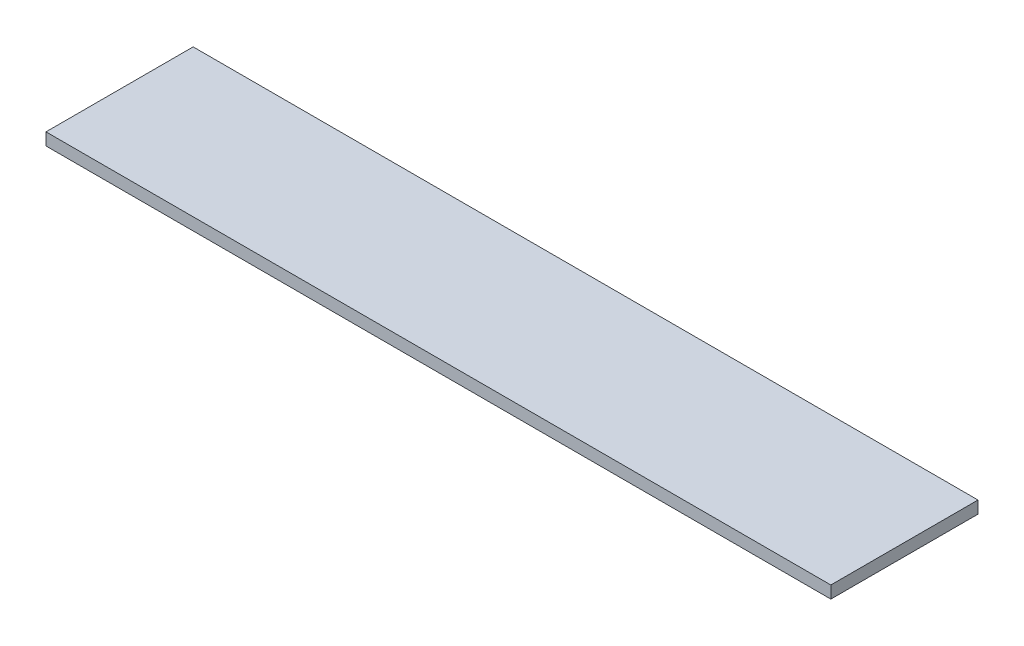
ISO-10303-21;
HEADER;
FILE_DESCRIPTION(('STEP AP214'),'2;1');
FILE_NAME('part.step','',(''),(''),'','','');
FILE_SCHEMA(('AUTOMOTIVE_DESIGN { 1 0 10303 214 1 1 1 1 }'));
ENDSEC;
DATA;
#1=APPLICATION_CONTEXT('core data for automotive mechanical design processes');
#2=APPLICATION_PROTOCOL_DEFINITION('international standard','automotive_design',2000,#1);
#3=PRODUCT_CONTEXT('',#1,'mechanical');
#4=PRODUCT('Part','Part','',(#3));
#5=PRODUCT_RELATED_PRODUCT_CATEGORY('part','',(#4));
#6=PRODUCT_DEFINITION_FORMATION('','',#4);
#7=PRODUCT_DEFINITION_CONTEXT('part definition',#1,'design');
#8=PRODUCT_DEFINITION('design','',#6,#7);
#9=PRODUCT_DEFINITION_SHAPE('','',#8);
#10=(LENGTH_UNIT() NAMED_UNIT(*) SI_UNIT(.MILLI.,.METRE.));
#11=(NAMED_UNIT(*) PLANE_ANGLE_UNIT() SI_UNIT($,.RADIAN.));
#12=(NAMED_UNIT(*) SI_UNIT($,.STERADIAN.) SOLID_ANGLE_UNIT());
#13=UNCERTAINTY_MEASURE_WITH_UNIT(LENGTH_MEASURE(1.E-05),#10,'distance_accuracy_value','');
#14=(GEOMETRIC_REPRESENTATION_CONTEXT(3) GLOBAL_UNCERTAINTY_ASSIGNED_CONTEXT((#13)) GLOBAL_UNIT_ASSIGNED_CONTEXT((#10,
#11,#12)) REPRESENTATION_CONTEXT('',''));
#15=CARTESIAN_POINT('',(0.,0.,0.));
#16=DIRECTION('',(0.,0.,1.));
#17=DIRECTION('',(1.,0.,0.));
#18=AXIS2_PLACEMENT_3D('',#15,#16,#17);
#19=CARTESIAN_POINT('',(0.,6.35000000000008,0.));
#20=DIRECTION('',(1.,0.,0.));
#21=DIRECTION('',(0.,0.,-1.));
#22=AXIS2_PLACEMENT_3D('',#19,#20,#21);
#23=PLANE('',#22);
#24=DIRECTION('',(0.,0.,1.));
#25=VECTOR('',#24,1.);
#26=CARTESIAN_POINT('',(0.,0.,0.));
#27=LINE('',#26,#25);
#28=CARTESIAN_POINT('',(0.,0.,-76.2));
#29=VERTEX_POINT('',#28);
#30=CARTESIAN_POINT('',(0.,0.,0.));
#31=VERTEX_POINT('',#30);
#32=EDGE_CURVE('E95',#29,#31,#27,.T.);
#33=ORIENTED_EDGE('',*,*,#32,.T.);
#34=DIRECTION('',(0.,-1.,0.));
#35=VECTOR('',#34,1.);
#36=CARTESIAN_POINT('',(0.,6.35000000000008,0.));
#37=LINE('',#36,#35);
#38=CARTESIAN_POINT('',(0.,6.35000000000008,0.));
#39=VERTEX_POINT('',#38);
#40=EDGE_CURVE('E11',#39,#31,#37,.T.);
#41=ORIENTED_EDGE('',*,*,#40,.F.);
#42=DIRECTION('',(0.,0.,1.));
#43=VECTOR('',#42,1.);
#44=CARTESIAN_POINT('',(0.,6.35000000000008,0.));
#45=LINE('',#44,#43);
#46=CARTESIAN_POINT('',(0.,6.35000000000008,-76.2));
#47=VERTEX_POINT('',#46);
#48=EDGE_CURVE('E83',#47,#39,#45,.T.);
#49=ORIENTED_EDGE('',*,*,#48,.F.);
#50=DIRECTION('',(0.,-1.,0.));
#51=VECTOR('',#50,1.);
#52=CARTESIAN_POINT('',(0.,6.35000000000008,-76.2));
#53=LINE('',#52,#51);
#54=EDGE_CURVE('E91',#47,#29,#53,.T.);
#55=ORIENTED_EDGE('',*,*,#54,.T.);
#56=EDGE_LOOP('',(#33,#41,#49,#55));
#57=FACE_BOUND('',#56,.T.);
#58=ADVANCED_FACE('F32',(#57),#23,.F.);
#59=CARTESIAN_POINT('',(0.,6.35000000000008,0.));
#60=DIRECTION('',(0.,0.,-1.));
#61=DIRECTION('',(-1.,0.,0.));
#62=AXIS2_PLACEMENT_3D('',#59,#60,#61);
#63=PLANE('',#62);
#64=DIRECTION('',(1.,0.,0.));
#65=VECTOR('',#64,1.);
#66=CARTESIAN_POINT('',(0.,0.,0.));
#67=LINE('',#66,#65);
#68=CARTESIAN_POINT('',(406.4,0.,0.));
#69=VERTEX_POINT('',#68);
#70=EDGE_CURVE('E87',#31,#69,#67,.T.);
#71=ORIENTED_EDGE('',*,*,#70,.T.);
#72=DIRECTION('',(0.,-1.,0.));
#73=VECTOR('',#72,1.);
#74=CARTESIAN_POINT('',(406.4,6.35000000000008,0.));
#75=LINE('',#74,#73);
#76=CARTESIAN_POINT('',(406.4,6.35000000000008,0.));
#77=VERTEX_POINT('',#76);
#78=EDGE_CURVE('E40',#77,#69,#75,.T.);
#79=ORIENTED_EDGE('',*,*,#78,.F.);
#80=DIRECTION('',(1.,0.,0.));
#81=VECTOR('',#80,1.);
#82=CARTESIAN_POINT('',(0.,6.35000000000008,0.));
#83=LINE('',#82,#81);
#84=EDGE_CURVE('E78',#39,#77,#83,.T.);
#85=ORIENTED_EDGE('',*,*,#84,.F.);
#86=ORIENTED_EDGE('',*,*,#40,.T.);
#87=EDGE_LOOP('',(#71,#79,#85,#86));
#88=FACE_BOUND('',#87,.T.);
#89=ADVANCED_FACE('F86',(#88),#63,.F.);
#90=CARTESIAN_POINT('',(406.4,6.35000000000008,0.));
#91=DIRECTION('',(-1.,0.,0.));
#92=DIRECTION('',(0.,0.,1.));
#93=AXIS2_PLACEMENT_3D('',#90,#91,#92);
#94=PLANE('',#93);
#95=DIRECTION('',(0.,0.,-1.));
#96=VECTOR('',#95,1.);
#97=CARTESIAN_POINT('',(406.4,0.,0.));
#98=LINE('',#97,#96);
#99=CARTESIAN_POINT('',(406.4,0.,-76.2));
#100=VERTEX_POINT('',#99);
#101=EDGE_CURVE('E65',#69,#100,#98,.T.);
#102=ORIENTED_EDGE('',*,*,#101,.T.);
#103=DIRECTION('',(0.,-1.,0.));
#104=VECTOR('',#103,1.);
#105=CARTESIAN_POINT('',(406.4,6.35000000000008,-76.2));
#106=LINE('',#105,#104);
#107=CARTESIAN_POINT('',(406.4,6.35000000000008,-76.2));
#108=VERTEX_POINT('',#107);
#109=EDGE_CURVE('E88',#108,#100,#106,.T.);
#110=ORIENTED_EDGE('',*,*,#109,.F.);
#111=DIRECTION('',(0.,0.,-1.));
#112=VECTOR('',#111,1.);
#113=CARTESIAN_POINT('',(406.4,6.35000000000008,0.));
#114=LINE('',#113,#112);
#115=EDGE_CURVE('E81',#77,#108,#114,.T.);
#116=ORIENTED_EDGE('',*,*,#115,.F.);
#117=ORIENTED_EDGE('',*,*,#78,.T.);
#118=EDGE_LOOP('',(#102,#110,#116,#117));
#119=FACE_BOUND('',#118,.T.);
#120=ADVANCED_FACE('F89',(#119),#94,.F.);
#121=CARTESIAN_POINT('',(0.,6.35000000000008,-76.2));
#122=DIRECTION('',(0.,0.,1.));
#123=DIRECTION('',(1.,0.,0.));
#124=AXIS2_PLACEMENT_3D('',#121,#122,#123);
#125=PLANE('',#124);
#126=DIRECTION('',(-1.,0.,0.));
#127=VECTOR('',#126,1.);
#128=CARTESIAN_POINT('',(0.,0.,-76.2));
#129=LINE('',#128,#127);
#130=EDGE_CURVE('E71',#100,#29,#129,.T.);
#131=ORIENTED_EDGE('',*,*,#130,.T.);
#132=ORIENTED_EDGE('',*,*,#54,.F.);
#133=DIRECTION('',(-1.,0.,0.));
#134=VECTOR('',#133,1.);
#135=CARTESIAN_POINT('',(0.,6.35000000000008,-76.2));
#136=LINE('',#135,#134);
#137=EDGE_CURVE('E48',#108,#47,#136,.T.);
#138=ORIENTED_EDGE('',*,*,#137,.F.);
#139=ORIENTED_EDGE('',*,*,#109,.T.);
#140=EDGE_LOOP('',(#131,#132,#138,#139));
#141=FACE_BOUND('',#140,.T.);
#142=ADVANCED_FACE('F102',(#141),#125,.F.);
#143=CARTESIAN_POINT('',(0.,6.35000000000008,0.));
#144=DIRECTION('',(0.,-1.,0.));
#145=DIRECTION('',(0.,0.,-1.));
#146=AXIS2_PLACEMENT_3D('',#143,#144,#145);
#147=PLANE('',#146);
#148=ORIENTED_EDGE('',*,*,#48,.T.);
#149=ORIENTED_EDGE('',*,*,#84,.T.);
#150=ORIENTED_EDGE('',*,*,#115,.T.);
#151=ORIENTED_EDGE('',*,*,#137,.T.);
#152=EDGE_LOOP('',(#148,#149,#150,#151));
#153=FACE_BOUND('',#152,.T.);
#154=ADVANCED_FACE('F79',(#153),#147,.F.);
#155=CARTESIAN_POINT('',(0.,0.,0.));
#156=DIRECTION('',(0.,-1.,0.));
#157=DIRECTION('',(0.,0.,-1.));
#158=AXIS2_PLACEMENT_3D('',#155,#156,#157);
#159=PLANE('',#158);
#160=ORIENTED_EDGE('',*,*,#32,.F.);
#161=ORIENTED_EDGE('',*,*,#130,.F.);
#162=ORIENTED_EDGE('',*,*,#101,.F.);
#163=ORIENTED_EDGE('',*,*,#70,.F.);
#164=EDGE_LOOP('',(#160,#161,#162,#163));
#165=FACE_BOUND('',#164,.T.);
#166=ADVANCED_FACE('F105',(#165),#159,.T.);
#167=CLOSED_SHELL('',(#58,#89,#120,#142,#154,#166));
#168=MANIFOLD_SOLID_BREP('B2',#167);
#169=ADVANCED_BREP_SHAPE_REPRESENTATION('',(#18,#168),#14);
#170=SHAPE_DEFINITION_REPRESENTATION(#9,#169);
ENDSEC;
END-ISO-10303-21;
